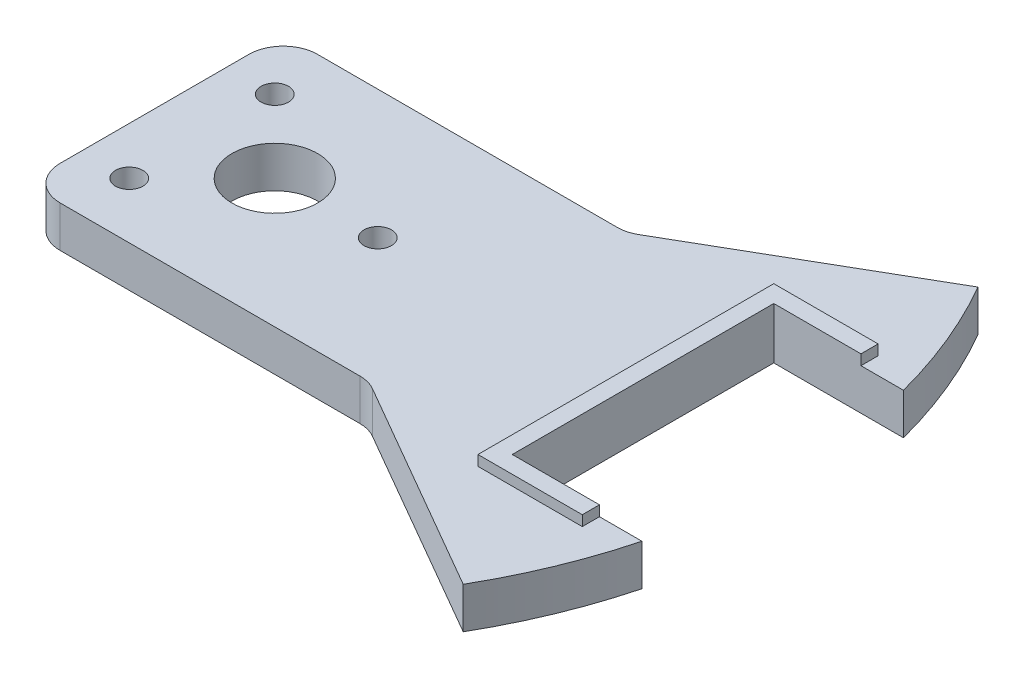
ISO-10303-21;
HEADER;
FILE_DESCRIPTION(('STEP AP214'),'2;1');
FILE_NAME('part.step','',(''),(''),'','','');
FILE_SCHEMA(('AUTOMOTIVE_DESIGN { 1 0 10303 214 1 1 1 1 }'));
ENDSEC;
DATA;
#1=APPLICATION_CONTEXT('core data for automotive mechanical design processes');
#2=APPLICATION_PROTOCOL_DEFINITION('international standard','automotive_design',2000,#1);
#3=PRODUCT_CONTEXT('',#1,'mechanical');
#4=PRODUCT('Part','Part','',(#3));
#5=PRODUCT_RELATED_PRODUCT_CATEGORY('part','',(#4));
#6=PRODUCT_DEFINITION_FORMATION('','',#4);
#7=PRODUCT_DEFINITION_CONTEXT('part definition',#1,'design');
#8=PRODUCT_DEFINITION('design','',#6,#7);
#9=PRODUCT_DEFINITION_SHAPE('','',#8);
#10=(LENGTH_UNIT() NAMED_UNIT(*) SI_UNIT(.MILLI.,.METRE.));
#11=(NAMED_UNIT(*) PLANE_ANGLE_UNIT() SI_UNIT($,.RADIAN.));
#12=(NAMED_UNIT(*) SI_UNIT($,.STERADIAN.) SOLID_ANGLE_UNIT());
#13=UNCERTAINTY_MEASURE_WITH_UNIT(LENGTH_MEASURE(1.E-05),#10,'distance_accuracy_value','');
#14=(GEOMETRIC_REPRESENTATION_CONTEXT(3) GLOBAL_UNCERTAINTY_ASSIGNED_CONTEXT((#13)) GLOBAL_UNIT_ASSIGNED_CONTEXT((#10,
#11,#12)) REPRESENTATION_CONTEXT('',''));
#15=CARTESIAN_POINT('',(0.,0.,0.));
#16=DIRECTION('',(0.,0.,1.));
#17=DIRECTION('',(1.,0.,0.));
#18=AXIS2_PLACEMENT_3D('',#15,#16,#17);
#19=CARTESIAN_POINT('',(0.,12.,0.));
#20=DIRECTION('',(0.,-1.,0.));
#21=DIRECTION('',(0.,0.,-1.));
#22=AXIS2_PLACEMENT_3D('',#19,#20,#21);
#23=CYLINDRICAL_SURFACE('',#22,150.);
#24=CARTESIAN_POINT('',(0.,12.,0.));
#25=DIRECTION('',(0.,1.,0.));
#26=DIRECTION('',(0.,0.,1.));
#27=AXIS2_PLACEMENT_3D('',#24,#25,#26);
#28=CIRCLE('',#27,150.);
#29=CARTESIAN_POINT('',(145.080632752963,12.,-38.1));
#30=VERTEX_POINT('',#29);
#31=CARTESIAN_POINT('',(129.903810567666,12.,-75.0000000000002));
#32=VERTEX_POINT('',#31);
#33=EDGE_CURVE('E272',#30,#32,#28,.T.);
#34=ORIENTED_EDGE('',*,*,#33,.F.);
#35=DIRECTION('',(0.,-1.,0.));
#36=VECTOR('',#35,1.);
#37=CARTESIAN_POINT('',(145.080632752963,12.,-38.1));
#38=LINE('',#37,#36);
#39=CARTESIAN_POINT('',(145.080632752963,0.,-38.1));
#40=VERTEX_POINT('',#39);
#41=EDGE_CURVE('E11',#30,#40,#38,.T.);
#42=ORIENTED_EDGE('',*,*,#41,.T.);
#43=CARTESIAN_POINT('',(0.,0.,0.));
#44=DIRECTION('',(0.,1.,0.));
#45=DIRECTION('',(0.,0.,1.));
#46=AXIS2_PLACEMENT_3D('',#43,#44,#45);
#47=CIRCLE('',#46,150.);
#48=CARTESIAN_POINT('',(129.903810567666,0.,-75.0000000000002));
#49=VERTEX_POINT('',#48);
#50=EDGE_CURVE('E265',#40,#49,#47,.T.);
#51=ORIENTED_EDGE('',*,*,#50,.T.);
#52=DIRECTION('',(0.,-1.,0.));
#53=VECTOR('',#52,1.);
#54=CARTESIAN_POINT('',(129.903810567666,12.,-75.0000000000002));
#55=LINE('',#54,#53);
#56=EDGE_CURVE('E338',#32,#49,#55,.T.);
#57=ORIENTED_EDGE('',*,*,#56,.F.);
#58=EDGE_LOOP('',(#34,#42,#51,#57));
#59=FACE_BOUND('',#58,.T.);
#60=ADVANCED_FACE('F35',(#59),#23,.T.);
#61=CARTESIAN_POINT('',(0.,12.,0.));
#62=DIRECTION('',(0.,1.,0.));
#63=DIRECTION('',(0.,0.,1.));
#64=AXIS2_PLACEMENT_3D('',#61,#62,#63);
#65=PLANE('',#64);
#66=DIRECTION('',(0.,0.,-1.));
#67=VECTOR('',#66,1.);
#68=CARTESIAN_POINT('',(132.7,12.,0.));
#69=LINE('',#68,#67);
#70=CARTESIAN_POINT('',(132.7,12.,-38.1));
#71=VERTEX_POINT('',#70);
#72=CARTESIAN_POINT('',(132.7,12.,-43.1));
#73=VERTEX_POINT('',#72);
#74=EDGE_CURVE('E211',#71,#73,#69,.T.);
#75=ORIENTED_EDGE('',*,*,#74,.F.);
#76=DIRECTION('',(-1.,0.,0.));
#77=VECTOR('',#76,1.);
#78=CARTESIAN_POINT('',(107.3,12.,-38.1));
#79=LINE('',#78,#77);
#80=EDGE_CURVE('E178',#30,#71,#79,.T.);
#81=ORIENTED_EDGE('',*,*,#80,.F.);
#82=ORIENTED_EDGE('',*,*,#33,.T.);
#83=DIRECTION('',(-0.866025403784437,0.,0.500000000000002));
#84=VECTOR('',#83,1.);
#85=CARTESIAN_POINT('',(67.2724133595216,12.,-38.8397459621556));
#86=LINE('',#85,#84);
#87=CARTESIAN_POINT('',(67.2724133595216,12.,-38.8397459621556));
#88=VERTEX_POINT('',#87);
#89=EDGE_CURVE('E271',#32,#88,#86,.T.);
#90=ORIENTED_EDGE('',*,*,#89,.T.);
#91=CARTESIAN_POINT('',(62.2724133595216,12.,-47.5000000000001));
#92=DIRECTION('',(0.,-1.,0.));
#93=DIRECTION('',(0.,0.,-1.));
#94=AXIS2_PLACEMENT_3D('',#91,#92,#93);
#95=CIRCLE('',#94,10.0000000000001);
#96=CARTESIAN_POINT('',(62.2724133595216,12.,-37.5));
#97=VERTEX_POINT('',#96);
#98=EDGE_CURVE('E274',#88,#97,#95,.T.);
#99=ORIENTED_EDGE('',*,*,#98,.T.);
#100=DIRECTION('',(-1.,0.,0.));
#101=VECTOR('',#100,1.);
#102=CARTESIAN_POINT('',(62.2724133595216,12.,-37.5));
#103=LINE('',#102,#101);
#104=CARTESIAN_POINT('',(-25.048094716167,12.,-37.4999999999998));
#105=VERTEX_POINT('',#104);
#106=EDGE_CURVE('E276',#97,#105,#103,.T.);
#107=ORIENTED_EDGE('',*,*,#106,.T.);
#108=CARTESIAN_POINT('',(-25.048094716167,12.,-27.4999999999998));
#109=DIRECTION('',(0.,1.,0.));
#110=DIRECTION('',(0.,0.,1.));
#111=AXIS2_PLACEMENT_3D('',#108,#109,#110);
#112=CIRCLE('',#111,10.);
#113=CARTESIAN_POINT('',(-35.048094716167,12.,-27.4999999999998));
#114=VERTEX_POINT('',#113);
#115=EDGE_CURVE('E278',#105,#114,#112,.T.);
#116=ORIENTED_EDGE('',*,*,#115,.T.);
#117=DIRECTION('',(0.,0.,1.));
#118=VECTOR('',#117,1.);
#119=CARTESIAN_POINT('',(-35.048094716167,12.,-27.4999999999998));
#120=LINE('',#119,#118);
#121=CARTESIAN_POINT('',(-35.0480947161671,12.,27.5000000000001));
#122=VERTEX_POINT('',#121);
#123=EDGE_CURVE('E280',#114,#122,#120,.T.);
#124=ORIENTED_EDGE('',*,*,#123,.T.);
#125=CARTESIAN_POINT('',(-25.0480947161671,12.,27.5000000000001));
#126=DIRECTION('',(0.,1.,0.));
#127=DIRECTION('',(0.,0.,1.));
#128=AXIS2_PLACEMENT_3D('',#125,#126,#127);
#129=CIRCLE('',#128,10.);
#130=CARTESIAN_POINT('',(-25.0480947161671,12.,37.5000000000001));
#131=VERTEX_POINT('',#130);
#132=EDGE_CURVE('E282',#122,#131,#129,.T.);
#133=ORIENTED_EDGE('',*,*,#132,.T.);
#134=DIRECTION('',(1.,0.,0.));
#135=VECTOR('',#134,1.);
#136=CARTESIAN_POINT('',(62.2724133595216,12.,37.5000000000001));
#137=LINE('',#136,#135);
#138=CARTESIAN_POINT('',(62.2724133595216,12.,37.5000000000001));
#139=VERTEX_POINT('',#138);
#140=EDGE_CURVE('E284',#131,#139,#137,.T.);
#141=ORIENTED_EDGE('',*,*,#140,.T.);
#142=CARTESIAN_POINT('',(62.2724133595216,12.,47.5000000000001));
#143=DIRECTION('',(0.,-1.,0.));
#144=DIRECTION('',(0.,0.,1.));
#145=AXIS2_PLACEMENT_3D('',#142,#143,#144);
#146=CIRCLE('',#145,10.);
#147=CARTESIAN_POINT('',(67.2724133595217,12.,38.8397459621557));
#148=VERTEX_POINT('',#147);
#149=EDGE_CURVE('E286',#139,#148,#146,.T.);
#150=ORIENTED_EDGE('',*,*,#149,.T.);
#151=DIRECTION('',(0.866025403784438,0.,0.500000000000001));
#152=VECTOR('',#151,1.);
#153=CARTESIAN_POINT('',(67.2724133595217,12.,38.8397459621557));
#154=LINE('',#153,#152);
#155=CARTESIAN_POINT('',(129.903810567666,12.,75.0000000000002));
#156=VERTEX_POINT('',#155);
#157=EDGE_CURVE('E288',#148,#156,#154,.T.);
#158=ORIENTED_EDGE('',*,*,#157,.T.);
#159=CARTESIAN_POINT('',(145.080632752963,12.,38.1));
#160=VERTEX_POINT('',#159);
#161=EDGE_CURVE('E268',#156,#160,#28,.T.);
#162=ORIENTED_EDGE('',*,*,#161,.T.);
#163=DIRECTION('',(1.,0.,0.));
#164=VECTOR('',#163,1.);
#165=CARTESIAN_POINT('',(107.3,12.,38.1));
#166=LINE('',#165,#164);
#167=CARTESIAN_POINT('',(132.7,12.,38.1));
#168=VERTEX_POINT('',#167);
#169=EDGE_CURVE('E58',#168,#160,#166,.T.);
#170=ORIENTED_EDGE('',*,*,#169,.F.);
#171=DIRECTION('',(0.,0.,1.));
#172=VECTOR('',#171,1.);
#173=CARTESIAN_POINT('',(132.7,12.,0.));
#174=LINE('',#173,#172);
#175=CARTESIAN_POINT('',(132.7,12.,43.1));
#176=VERTEX_POINT('',#175);
#177=EDGE_CURVE('E209',#168,#176,#174,.T.);
#178=ORIENTED_EDGE('',*,*,#177,.T.);
#179=DIRECTION('',(-1.,0.,0.));
#180=VECTOR('',#179,1.);
#181=CARTESIAN_POINT('',(0.,12.,43.1));
#182=LINE('',#181,#180);
#183=CARTESIAN_POINT('',(102.3,12.,43.1));
#184=VERTEX_POINT('',#183);
#185=EDGE_CURVE('E50',#176,#184,#182,.T.);
#186=ORIENTED_EDGE('',*,*,#185,.T.);
#187=DIRECTION('',(0.,0.,1.));
#188=VECTOR('',#187,1.);
#189=CARTESIAN_POINT('',(102.3,12.,0.));
#190=LINE('',#189,#188);
#191=CARTESIAN_POINT('',(102.3,12.,-43.1));
#192=VERTEX_POINT('',#191);
#193=EDGE_CURVE('E189',#192,#184,#190,.T.);
#194=ORIENTED_EDGE('',*,*,#193,.F.);
#195=DIRECTION('',(-1.,0.,0.));
#196=VECTOR('',#195,1.);
#197=CARTESIAN_POINT('',(0.,12.,-43.1));
#198=LINE('',#197,#196);
#199=EDGE_CURVE('E213',#73,#192,#198,.T.);
#200=ORIENTED_EDGE('',*,*,#199,.F.);
#201=EDGE_LOOP('',(#75,#81,#82,#90,#99,#107,#116,#124,#133,#141,#150,#158,#162,#170,#178,#186,
#194,#200));
#202=FACE_BOUND('',#201,.T.);
#203=CARTESIAN_POINT('',(-21.2132034355965,12.,-21.2132034355963));
#204=DIRECTION('',(0.,1.,0.));
#205=DIRECTION('',(0.,0.,1.));
#206=AXIS2_PLACEMENT_3D('',#203,#204,#205);
#207=CIRCLE('',#206,4.);
#208=CARTESIAN_POINT('',(-21.2132034355965,12.,-17.2132034355963));
#209=VERTEX_POINT('',#208);
#210=EDGE_CURVE('E250',#209,#209,#207,.T.);
#211=ORIENTED_EDGE('',*,*,#210,.F.);
#212=EDGE_LOOP('',(#211));
#213=FACE_BOUND('',#212,.T.);
#214=CARTESIAN_POINT('',(0.,12.,0.));
#215=DIRECTION('',(0.,1.,0.));
#216=DIRECTION('',(0.,0.,1.));
#217=AXIS2_PLACEMENT_3D('',#214,#215,#216);
#218=CIRCLE('',#217,12.5);
#219=CARTESIAN_POINT('',(0.,12.,12.5));
#220=VERTEX_POINT('',#219);
#221=EDGE_CURVE('E262',#220,#220,#218,.T.);
#222=ORIENTED_EDGE('',*,*,#221,.F.);
#223=EDGE_LOOP('',(#222));
#224=FACE_BOUND('',#223,.T.);
#225=CARTESIAN_POINT('',(30.,12.,0.));
#226=DIRECTION('',(0.,1.,0.));
#227=DIRECTION('',(0.,0.,1.));
#228=AXIS2_PLACEMENT_3D('',#225,#226,#227);
#229=CIRCLE('',#228,4.00000000000001);
#230=CARTESIAN_POINT('',(30.,12.,4.00000000000001));
#231=VERTEX_POINT('',#230);
#232=EDGE_CURVE('E256',#231,#231,#229,.T.);
#233=ORIENTED_EDGE('',*,*,#232,.F.);
#234=EDGE_LOOP('',(#233));
#235=FACE_BOUND('',#234,.T.);
#236=CARTESIAN_POINT('',(-21.2132034355965,12.,21.2132034355963));
#237=DIRECTION('',(0.,1.,0.));
#238=DIRECTION('',(0.,0.,-1.));
#239=AXIS2_PLACEMENT_3D('',#236,#237,#238);
#240=CIRCLE('',#239,4.);
#241=CARTESIAN_POINT('',(-21.2132034355965,12.,17.2132034355963));
#242=VERTEX_POINT('',#241);
#243=EDGE_CURVE('E244',#242,#242,#240,.T.);
#244=ORIENTED_EDGE('',*,*,#243,.F.);
#245=EDGE_LOOP('',(#244));
#246=FACE_BOUND('',#245,.T.);
#247=ADVANCED_FACE('F346',(#202,#213,#224,#235,#246),#65,.T.);
#248=CARTESIAN_POINT('',(0.,0.,0.));
#249=DIRECTION('',(0.,1.,0.));
#250=DIRECTION('',(0.,0.,1.));
#251=AXIS2_PLACEMENT_3D('',#248,#249,#250);
#252=PLANE('',#251);
#253=ORIENTED_EDGE('',*,*,#50,.F.);
#254=DIRECTION('',(-1.,0.,0.));
#255=VECTOR('',#254,1.);
#256=CARTESIAN_POINT('',(107.3,0.,-38.1));
#257=LINE('',#256,#255);
#258=CARTESIAN_POINT('',(107.3,0.,-38.1));
#259=VERTEX_POINT('',#258);
#260=EDGE_CURVE('E227',#40,#259,#257,.T.);
#261=ORIENTED_EDGE('',*,*,#260,.T.);
#262=DIRECTION('',(0.,0.,1.));
#263=VECTOR('',#262,1.);
#264=CARTESIAN_POINT('',(107.3,0.,-38.1));
#265=LINE('',#264,#263);
#266=CARTESIAN_POINT('',(107.3,0.,38.1));
#267=VERTEX_POINT('',#266);
#268=EDGE_CURVE('E230',#259,#267,#265,.T.);
#269=ORIENTED_EDGE('',*,*,#268,.T.);
#270=DIRECTION('',(1.,0.,0.));
#271=VECTOR('',#270,1.);
#272=CARTESIAN_POINT('',(107.3,0.,38.1));
#273=LINE('',#272,#271);
#274=CARTESIAN_POINT('',(145.080632752963,0.,38.1));
#275=VERTEX_POINT('',#274);
#276=EDGE_CURVE('E233',#267,#275,#273,.T.);
#277=ORIENTED_EDGE('',*,*,#276,.T.);
#278=CARTESIAN_POINT('',(129.903810567666,0.,75.0000000000002));
#279=VERTEX_POINT('',#278);
#280=EDGE_CURVE('E291',#279,#275,#47,.T.);
#281=ORIENTED_EDGE('',*,*,#280,.F.);
#282=DIRECTION('',(0.866025403784438,0.,0.500000000000001));
#283=VECTOR('',#282,1.);
#284=CARTESIAN_POINT('',(67.2724133595217,0.,38.8397459621557));
#285=LINE('',#284,#283);
#286=CARTESIAN_POINT('',(67.2724133595217,0.,38.8397459621557));
#287=VERTEX_POINT('',#286);
#288=EDGE_CURVE('E310',#287,#279,#285,.T.);
#289=ORIENTED_EDGE('',*,*,#288,.F.);
#290=CARTESIAN_POINT('',(62.2724133595216,0.,47.5000000000001));
#291=DIRECTION('',(0.,-1.,0.));
#292=DIRECTION('',(0.,0.,1.));
#293=AXIS2_PLACEMENT_3D('',#290,#291,#292);
#294=CIRCLE('',#293,10.);
#295=CARTESIAN_POINT('',(62.2724133595216,0.,37.5000000000001));
#296=VERTEX_POINT('',#295);
#297=EDGE_CURVE('E308',#296,#287,#294,.T.);
#298=ORIENTED_EDGE('',*,*,#297,.F.);
#299=DIRECTION('',(1.,0.,0.));
#300=VECTOR('',#299,1.);
#301=CARTESIAN_POINT('',(62.2724133595216,0.,37.5000000000001));
#302=LINE('',#301,#300);
#303=CARTESIAN_POINT('',(-25.0480947161671,0.,37.5000000000001));
#304=VERTEX_POINT('',#303);
#305=EDGE_CURVE('E306',#304,#296,#302,.T.);
#306=ORIENTED_EDGE('',*,*,#305,.F.);
#307=CARTESIAN_POINT('',(-25.0480947161671,0.,27.5000000000001));
#308=DIRECTION('',(0.,1.,0.));
#309=DIRECTION('',(0.,0.,1.));
#310=AXIS2_PLACEMENT_3D('',#307,#308,#309);
#311=CIRCLE('',#310,10.);
#312=CARTESIAN_POINT('',(-35.0480947161671,0.,27.5000000000001));
#313=VERTEX_POINT('',#312);
#314=EDGE_CURVE('E304',#313,#304,#311,.T.);
#315=ORIENTED_EDGE('',*,*,#314,.F.);
#316=DIRECTION('',(0.,0.,1.));
#317=VECTOR('',#316,1.);
#318=CARTESIAN_POINT('',(-35.048094716167,0.,-27.4999999999998));
#319=LINE('',#318,#317);
#320=CARTESIAN_POINT('',(-35.048094716167,0.,-27.4999999999998));
#321=VERTEX_POINT('',#320);
#322=EDGE_CURVE('E302',#321,#313,#319,.T.);
#323=ORIENTED_EDGE('',*,*,#322,.F.);
#324=CARTESIAN_POINT('',(-25.048094716167,0.,-27.4999999999998));
#325=DIRECTION('',(0.,1.,0.));
#326=DIRECTION('',(0.,0.,1.));
#327=AXIS2_PLACEMENT_3D('',#324,#325,#326);
#328=CIRCLE('',#327,10.);
#329=CARTESIAN_POINT('',(-25.048094716167,0.,-37.4999999999998));
#330=VERTEX_POINT('',#329);
#331=EDGE_CURVE('E300',#330,#321,#328,.T.);
#332=ORIENTED_EDGE('',*,*,#331,.F.);
#333=DIRECTION('',(-1.,0.,0.));
#334=VECTOR('',#333,1.);
#335=CARTESIAN_POINT('',(62.2724133595216,0.,-37.5));
#336=LINE('',#335,#334);
#337=CARTESIAN_POINT('',(62.2724133595216,0.,-37.5));
#338=VERTEX_POINT('',#337);
#339=EDGE_CURVE('E298',#338,#330,#336,.T.);
#340=ORIENTED_EDGE('',*,*,#339,.F.);
#341=CARTESIAN_POINT('',(62.2724133595216,0.,-47.5000000000001));
#342=DIRECTION('',(0.,-1.,0.));
#343=DIRECTION('',(0.,0.,-1.));
#344=AXIS2_PLACEMENT_3D('',#341,#342,#343);
#345=CIRCLE('',#344,10.0000000000001);
#346=CARTESIAN_POINT('',(67.2724133595216,0.,-38.8397459621556));
#347=VERTEX_POINT('',#346);
#348=EDGE_CURVE('E296',#347,#338,#345,.T.);
#349=ORIENTED_EDGE('',*,*,#348,.F.);
#350=DIRECTION('',(-0.866025403784437,0.,0.500000000000002));
#351=VECTOR('',#350,1.);
#352=CARTESIAN_POINT('',(67.2724133595216,0.,-38.8397459621556));
#353=LINE('',#352,#351);
#354=EDGE_CURVE('E294',#49,#347,#353,.T.);
#355=ORIENTED_EDGE('',*,*,#354,.F.);
#356=EDGE_LOOP('',(#253,#261,#269,#277,#281,#289,#298,#306,#315,#323,#332,#340,#349,#355));
#357=FACE_BOUND('',#356,.T.);
#358=CARTESIAN_POINT('',(0.,0.,0.));
#359=DIRECTION('',(0.,1.,0.));
#360=DIRECTION('',(0.,0.,1.));
#361=AXIS2_PLACEMENT_3D('',#358,#359,#360);
#362=CIRCLE('',#361,12.5);
#363=CARTESIAN_POINT('',(0.,0.,12.5));
#364=VERTEX_POINT('',#363);
#365=EDGE_CURVE('E259',#364,#364,#362,.T.);
#366=ORIENTED_EDGE('',*,*,#365,.T.);
#367=EDGE_LOOP('',(#366));
#368=FACE_BOUND('',#367,.T.);
#369=CARTESIAN_POINT('',(30.,0.,0.));
#370=DIRECTION('',(0.,1.,0.));
#371=DIRECTION('',(0.,0.,1.));
#372=AXIS2_PLACEMENT_3D('',#369,#370,#371);
#373=CIRCLE('',#372,4.00000000000001);
#374=CARTESIAN_POINT('',(30.,0.,4.00000000000001));
#375=VERTEX_POINT('',#374);
#376=EDGE_CURVE('E253',#375,#375,#373,.T.);
#377=ORIENTED_EDGE('',*,*,#376,.T.);
#378=EDGE_LOOP('',(#377));
#379=FACE_BOUND('',#378,.T.);
#380=CARTESIAN_POINT('',(-21.2132034355965,0.,-21.2132034355963));
#381=DIRECTION('',(0.,1.,0.));
#382=DIRECTION('',(0.,0.,1.));
#383=AXIS2_PLACEMENT_3D('',#380,#381,#382);
#384=CIRCLE('',#383,4.);
#385=CARTESIAN_POINT('',(-21.2132034355965,0.,-17.2132034355963));
#386=VERTEX_POINT('',#385);
#387=EDGE_CURVE('E247',#386,#386,#384,.T.);
#388=ORIENTED_EDGE('',*,*,#387,.T.);
#389=EDGE_LOOP('',(#388));
#390=FACE_BOUND('',#389,.T.);
#391=CARTESIAN_POINT('',(-21.2132034355965,0.,21.2132034355963));
#392=DIRECTION('',(0.,1.,0.));
#393=DIRECTION('',(0.,0.,-1.));
#394=AXIS2_PLACEMENT_3D('',#391,#392,#393);
#395=CIRCLE('',#394,4.);
#396=CARTESIAN_POINT('',(-21.2132034355965,0.,17.2132034355963));
#397=VERTEX_POINT('',#396);
#398=EDGE_CURVE('E242',#397,#397,#395,.T.);
#399=ORIENTED_EDGE('',*,*,#398,.T.);
#400=EDGE_LOOP('',(#399));
#401=FACE_BOUND('',#400,.T.);
#402=ADVANCED_FACE('F357',(#357,#368,#379,#390,#401),#252,.F.);
#403=ORIENTED_EDGE('',*,*,#280,.T.);
#404=DIRECTION('',(0.,-1.,0.));
#405=VECTOR('',#404,1.);
#406=CARTESIAN_POINT('',(145.080632752963,12.,38.1));
#407=LINE('',#406,#405);
#408=EDGE_CURVE('E43',#275,#160,#407,.F.);
#409=ORIENTED_EDGE('',*,*,#408,.T.);
#410=ORIENTED_EDGE('',*,*,#161,.F.);
#411=DIRECTION('',(0.,-1.,0.));
#412=VECTOR('',#411,1.);
#413=CARTESIAN_POINT('',(129.903810567666,12.,75.0000000000002));
#414=LINE('',#413,#412);
#415=EDGE_CURVE('E290',#156,#279,#414,.T.);
#416=ORIENTED_EDGE('',*,*,#415,.T.);
#417=EDGE_LOOP('',(#403,#409,#410,#416));
#418=FACE_BOUND('',#417,.T.);
#419=ADVANCED_FACE('F37',(#418),#23,.T.);
#420=CARTESIAN_POINT('',(67.2724133595216,12.,-38.8397459621556));
#421=DIRECTION('',(0.500000000000002,0.,0.866025403784437));
#422=DIRECTION('',(0.866025403784437,0.,-0.500000000000002));
#423=AXIS2_PLACEMENT_3D('',#420,#421,#422);
#424=PLANE('',#423);
#425=ORIENTED_EDGE('',*,*,#354,.T.);
#426=DIRECTION('',(0.,-1.,0.));
#427=VECTOR('',#426,1.);
#428=CARTESIAN_POINT('',(67.2724133595216,12.,-38.8397459621556));
#429=LINE('',#428,#427);
#430=EDGE_CURVE('E335',#88,#347,#429,.T.);
#431=ORIENTED_EDGE('',*,*,#430,.F.);
#432=ORIENTED_EDGE('',*,*,#89,.F.);
#433=ORIENTED_EDGE('',*,*,#56,.T.);
#434=EDGE_LOOP('',(#425,#431,#432,#433));
#435=FACE_BOUND('',#434,.T.);
#436=ADVANCED_FACE('F391',(#435),#424,.F.);
#437=CARTESIAN_POINT('',(62.2724133595216,12.,-47.5000000000001));
#438=DIRECTION('',(0.,-1.,0.));
#439=DIRECTION('',(0.,0.,-1.));
#440=AXIS2_PLACEMENT_3D('',#437,#438,#439);
#441=CYLINDRICAL_SURFACE('',#440,10.0000000000001);
#442=ORIENTED_EDGE('',*,*,#348,.T.);
#443=DIRECTION('',(0.,-1.,0.));
#444=VECTOR('',#443,1.);
#445=CARTESIAN_POINT('',(62.2724133595216,12.,-37.5));
#446=LINE('',#445,#444);
#447=EDGE_CURVE('E332',#97,#338,#446,.T.);
#448=ORIENTED_EDGE('',*,*,#447,.F.);
#449=ORIENTED_EDGE('',*,*,#98,.F.);
#450=ORIENTED_EDGE('',*,*,#430,.T.);
#451=EDGE_LOOP('',(#442,#448,#449,#450));
#452=FACE_BOUND('',#451,.T.);
#453=ADVANCED_FACE('F397',(#452),#441,.F.);
#454=CARTESIAN_POINT('',(62.2724133595216,12.,-37.5));
#455=DIRECTION('',(0.,0.,1.));
#456=DIRECTION('',(1.,0.,0.));
#457=AXIS2_PLACEMENT_3D('',#454,#455,#456);
#458=PLANE('',#457);
#459=ORIENTED_EDGE('',*,*,#339,.T.);
#460=DIRECTION('',(0.,-1.,0.));
#461=VECTOR('',#460,1.);
#462=CARTESIAN_POINT('',(-25.048094716167,12.,-37.4999999999998));
#463=LINE('',#462,#461);
#464=EDGE_CURVE('E329',#105,#330,#463,.T.);
#465=ORIENTED_EDGE('',*,*,#464,.F.);
#466=ORIENTED_EDGE('',*,*,#106,.F.);
#467=ORIENTED_EDGE('',*,*,#447,.T.);
#468=EDGE_LOOP('',(#459,#465,#466,#467));
#469=FACE_BOUND('',#468,.T.);
#470=ADVANCED_FACE('F399',(#469),#458,.F.);
#471=CARTESIAN_POINT('',(-25.048094716167,12.,-27.4999999999998));
#472=DIRECTION('',(0.,-1.,0.));
#473=DIRECTION('',(0.,0.,-1.));
#474=AXIS2_PLACEMENT_3D('',#471,#472,#473);
#475=CYLINDRICAL_SURFACE('',#474,10.);
#476=ORIENTED_EDGE('',*,*,#331,.T.);
#477=DIRECTION('',(0.,-1.,0.));
#478=VECTOR('',#477,1.);
#479=CARTESIAN_POINT('',(-35.048094716167,12.,-27.4999999999998));
#480=LINE('',#479,#478);
#481=EDGE_CURVE('E326',#114,#321,#480,.T.);
#482=ORIENTED_EDGE('',*,*,#481,.F.);
#483=ORIENTED_EDGE('',*,*,#115,.F.);
#484=ORIENTED_EDGE('',*,*,#464,.T.);
#485=EDGE_LOOP('',(#476,#482,#483,#484));
#486=FACE_BOUND('',#485,.T.);
#487=ADVANCED_FACE('F404',(#486),#475,.T.);
#488=CARTESIAN_POINT('',(-35.048094716167,12.,-27.4999999999998));
#489=DIRECTION('',(1.,0.,0.));
#490=DIRECTION('',(0.,0.,-1.));
#491=AXIS2_PLACEMENT_3D('',#488,#489,#490);
#492=PLANE('',#491);
#493=ORIENTED_EDGE('',*,*,#322,.T.);
#494=DIRECTION('',(0.,-1.,0.));
#495=VECTOR('',#494,1.);
#496=CARTESIAN_POINT('',(-35.0480947161671,12.,27.5000000000001));
#497=LINE('',#496,#495);
#498=EDGE_CURVE('E323',#122,#313,#497,.T.);
#499=ORIENTED_EDGE('',*,*,#498,.F.);
#500=ORIENTED_EDGE('',*,*,#123,.F.);
#501=ORIENTED_EDGE('',*,*,#481,.T.);
#502=EDGE_LOOP('',(#493,#499,#500,#501));
#503=FACE_BOUND('',#502,.T.);
#504=ADVANCED_FACE('F410',(#503),#492,.F.);
#505=CARTESIAN_POINT('',(-25.0480947161671,12.,27.5000000000001));
#506=DIRECTION('',(0.,-1.,0.));
#507=DIRECTION('',(0.,0.,-1.));
#508=AXIS2_PLACEMENT_3D('',#505,#506,#507);
#509=CYLINDRICAL_SURFACE('',#508,10.);
#510=ORIENTED_EDGE('',*,*,#314,.T.);
#511=DIRECTION('',(0.,-1.,0.));
#512=VECTOR('',#511,1.);
#513=CARTESIAN_POINT('',(-25.0480947161671,12.,37.5000000000001));
#514=LINE('',#513,#512);
#515=EDGE_CURVE('E320',#131,#304,#514,.T.);
#516=ORIENTED_EDGE('',*,*,#515,.F.);
#517=ORIENTED_EDGE('',*,*,#132,.F.);
#518=ORIENTED_EDGE('',*,*,#498,.T.);
#519=EDGE_LOOP('',(#510,#516,#517,#518));
#520=FACE_BOUND('',#519,.T.);
#521=ADVANCED_FACE('F414',(#520),#509,.T.);
#522=CARTESIAN_POINT('',(62.2724133595216,12.,37.5000000000001));
#523=DIRECTION('',(0.,0.,-1.));
#524=DIRECTION('',(-1.,0.,0.));
#525=AXIS2_PLACEMENT_3D('',#522,#523,#524);
#526=PLANE('',#525);
#527=ORIENTED_EDGE('',*,*,#305,.T.);
#528=DIRECTION('',(0.,-1.,0.));
#529=VECTOR('',#528,1.);
#530=CARTESIAN_POINT('',(62.2724133595216,12.,37.5000000000001));
#531=LINE('',#530,#529);
#532=EDGE_CURVE('E317',#139,#296,#531,.T.);
#533=ORIENTED_EDGE('',*,*,#532,.F.);
#534=ORIENTED_EDGE('',*,*,#140,.F.);
#535=ORIENTED_EDGE('',*,*,#515,.T.);
#536=EDGE_LOOP('',(#527,#533,#534,#535));
#537=FACE_BOUND('',#536,.T.);
#538=ADVANCED_FACE('F419',(#537),#526,.F.);
#539=CARTESIAN_POINT('',(62.2724133595216,12.,47.5000000000001));
#540=DIRECTION('',(0.,-1.,0.));
#541=DIRECTION('',(0.,0.,-1.));
#542=AXIS2_PLACEMENT_3D('',#539,#540,#541);
#543=CYLINDRICAL_SURFACE('',#542,10.);
#544=ORIENTED_EDGE('',*,*,#297,.T.);
#545=DIRECTION('',(0.,-1.,0.));
#546=VECTOR('',#545,1.);
#547=CARTESIAN_POINT('',(67.2724133595217,12.,38.8397459621557));
#548=LINE('',#547,#546);
#549=EDGE_CURVE('E314',#148,#287,#548,.T.);
#550=ORIENTED_EDGE('',*,*,#549,.F.);
#551=ORIENTED_EDGE('',*,*,#149,.F.);
#552=ORIENTED_EDGE('',*,*,#532,.T.);
#553=EDGE_LOOP('',(#544,#550,#551,#552));
#554=FACE_BOUND('',#553,.T.);
#555=ADVANCED_FACE('F421',(#554),#543,.F.);
#556=CARTESIAN_POINT('',(67.2724133595217,12.,38.8397459621557));
#557=DIRECTION('',(0.500000000000001,0.,-0.866025403784438));
#558=DIRECTION('',(-0.866025403784438,0.,-0.500000000000001));
#559=AXIS2_PLACEMENT_3D('',#556,#557,#558);
#560=PLANE('',#559);
#561=ORIENTED_EDGE('',*,*,#288,.T.);
#562=ORIENTED_EDGE('',*,*,#415,.F.);
#563=ORIENTED_EDGE('',*,*,#157,.F.);
#564=ORIENTED_EDGE('',*,*,#549,.T.);
#565=EDGE_LOOP('',(#561,#562,#563,#564));
#566=FACE_BOUND('',#565,.T.);
#567=ADVANCED_FACE('F353',(#566),#560,.F.);
#568=CARTESIAN_POINT('',(0.,12.,0.));
#569=DIRECTION('',(0.,-1.,0.));
#570=DIRECTION('',(0.,0.,-1.));
#571=AXIS2_PLACEMENT_3D('',#568,#569,#570);
#572=CYLINDRICAL_SURFACE('',#571,12.5);
#573=ORIENTED_EDGE('',*,*,#221,.T.);
#574=EDGE_LOOP('',(#573));
#575=FACE_BOUND('',#574,.T.);
#576=ORIENTED_EDGE('',*,*,#365,.F.);
#577=EDGE_LOOP('',(#576));
#578=FACE_BOUND('',#577,.T.);
#579=ADVANCED_FACE('F428',(#575,#578),#572,.F.);
#580=CARTESIAN_POINT('',(30.,12.,0.));
#581=DIRECTION('',(0.,-1.,0.));
#582=DIRECTION('',(0.,0.,-1.));
#583=AXIS2_PLACEMENT_3D('',#580,#581,#582);
#584=CYLINDRICAL_SURFACE('',#583,4.00000000000001);
#585=ORIENTED_EDGE('',*,*,#232,.T.);
#586=EDGE_LOOP('',(#585));
#587=FACE_BOUND('',#586,.T.);
#588=ORIENTED_EDGE('',*,*,#376,.F.);
#589=EDGE_LOOP('',(#588));
#590=FACE_BOUND('',#589,.T.);
#591=ADVANCED_FACE('F447',(#587,#590),#584,.F.);
#592=CARTESIAN_POINT('',(-21.2132034355965,12.,-21.2132034355963));
#593=DIRECTION('',(0.,-1.,0.));
#594=DIRECTION('',(0.,0.,-1.));
#595=AXIS2_PLACEMENT_3D('',#592,#593,#594);
#596=CYLINDRICAL_SURFACE('',#595,4.);
#597=ORIENTED_EDGE('',*,*,#210,.T.);
#598=EDGE_LOOP('',(#597));
#599=FACE_BOUND('',#598,.T.);
#600=ORIENTED_EDGE('',*,*,#387,.F.);
#601=EDGE_LOOP('',(#600));
#602=FACE_BOUND('',#601,.T.);
#603=ADVANCED_FACE('F451',(#599,#602),#596,.F.);
#604=CARTESIAN_POINT('',(-21.2132034355965,12.,21.2132034355963));
#605=DIRECTION('',(0.,-1.,0.));
#606=DIRECTION('',(0.,0.,-1.));
#607=AXIS2_PLACEMENT_3D('',#604,#605,#606);
#608=CYLINDRICAL_SURFACE('',#607,4.);
#609=ORIENTED_EDGE('',*,*,#243,.T.);
#610=EDGE_LOOP('',(#609));
#611=FACE_BOUND('',#610,.T.);
#612=ORIENTED_EDGE('',*,*,#398,.F.);
#613=EDGE_LOOP('',(#612));
#614=FACE_BOUND('',#613,.T.);
#615=ADVANCED_FACE('F455',(#611,#614),#608,.F.);
#616=CARTESIAN_POINT('',(107.3,0.,-38.1));
#617=DIRECTION('',(0.,0.,-1.));
#618=DIRECTION('',(-1.,0.,0.));
#619=AXIS2_PLACEMENT_3D('',#616,#617,#618);
#620=PLANE('',#619);
#621=ORIENTED_EDGE('',*,*,#80,.T.);
#622=DIRECTION('',(0.,-1.,0.));
#623=VECTOR('',#622,1.);
#624=CARTESIAN_POINT('',(132.7,15.,-38.1));
#625=LINE('',#624,#623);
#626=CARTESIAN_POINT('',(132.7,15.,-38.1));
#627=VERTEX_POINT('',#626);
#628=EDGE_CURVE('E224',#627,#71,#625,.T.);
#629=ORIENTED_EDGE('',*,*,#628,.F.);
#630=DIRECTION('',(1.,0.,0.));
#631=VECTOR('',#630,1.);
#632=CARTESIAN_POINT('',(0.,15.,-38.1));
#633=LINE('',#632,#631);
#634=CARTESIAN_POINT('',(107.3,15.,-38.1));
#635=VERTEX_POINT('',#634);
#636=EDGE_CURVE('E200',#635,#627,#633,.T.);
#637=ORIENTED_EDGE('',*,*,#636,.F.);
#638=DIRECTION('',(0.,1.,0.));
#639=VECTOR('',#638,1.);
#640=CARTESIAN_POINT('',(107.3,0.,-38.1));
#641=LINE('',#640,#639);
#642=EDGE_CURVE('E236',#259,#635,#641,.T.);
#643=ORIENTED_EDGE('',*,*,#642,.F.);
#644=ORIENTED_EDGE('',*,*,#260,.F.);
#645=ORIENTED_EDGE('',*,*,#41,.F.);
#646=EDGE_LOOP('',(#621,#629,#637,#643,#644,#645));
#647=FACE_BOUND('',#646,.T.);
#648=ADVANCED_FACE('F367',(#647),#620,.F.);
#649=CARTESIAN_POINT('',(107.3,0.,38.1));
#650=DIRECTION('',(0.,0.,1.));
#651=DIRECTION('',(1.,0.,0.));
#652=AXIS2_PLACEMENT_3D('',#649,#650,#651);
#653=PLANE('',#652);
#654=ORIENTED_EDGE('',*,*,#276,.F.);
#655=DIRECTION('',(0.,1.,0.));
#656=VECTOR('',#655,1.);
#657=CARTESIAN_POINT('',(107.3,0.,38.1));
#658=LINE('',#657,#656);
#659=CARTESIAN_POINT('',(107.3,15.,38.1));
#660=VERTEX_POINT('',#659);
#661=EDGE_CURVE('E240',#267,#660,#658,.T.);
#662=ORIENTED_EDGE('',*,*,#661,.T.);
#663=DIRECTION('',(-1.,0.,0.));
#664=VECTOR('',#663,1.);
#665=CARTESIAN_POINT('',(0.,15.,38.1));
#666=LINE('',#665,#664);
#667=CARTESIAN_POINT('',(132.7,15.,38.1));
#668=VERTEX_POINT('',#667);
#669=EDGE_CURVE('E193',#668,#660,#666,.T.);
#670=ORIENTED_EDGE('',*,*,#669,.F.);
#671=DIRECTION('',(0.,-1.,0.));
#672=VECTOR('',#671,1.);
#673=CARTESIAN_POINT('',(132.7,15.,38.1));
#674=LINE('',#673,#672);
#675=EDGE_CURVE('E179',#668,#168,#674,.T.);
#676=ORIENTED_EDGE('',*,*,#675,.T.);
#677=ORIENTED_EDGE('',*,*,#169,.T.);
#678=ORIENTED_EDGE('',*,*,#408,.F.);
#679=EDGE_LOOP('',(#654,#662,#670,#676,#677,#678));
#680=FACE_BOUND('',#679,.T.);
#681=ADVANCED_FACE('F361',(#680),#653,.F.);
#682=CARTESIAN_POINT('',(107.3,0.,-38.1));
#683=DIRECTION('',(-1.,0.,0.));
#684=DIRECTION('',(0.,0.,1.));
#685=AXIS2_PLACEMENT_3D('',#682,#683,#684);
#686=PLANE('',#685);
#687=ORIENTED_EDGE('',*,*,#642,.T.);
#688=DIRECTION('',(0.,0.,-1.));
#689=VECTOR('',#688,1.);
#690=CARTESIAN_POINT('',(107.3,15.,0.));
#691=LINE('',#690,#689);
#692=EDGE_CURVE('E195',#660,#635,#691,.T.);
#693=ORIENTED_EDGE('',*,*,#692,.F.);
#694=ORIENTED_EDGE('',*,*,#661,.F.);
#695=ORIENTED_EDGE('',*,*,#268,.F.);
#696=EDGE_LOOP('',(#687,#693,#694,#695));
#697=FACE_BOUND('',#696,.T.);
#698=ADVANCED_FACE('F365',(#697),#686,.F.);
#699=CARTESIAN_POINT('',(0.,15.,43.1));
#700=DIRECTION('',(0.,0.,1.));
#701=DIRECTION('',(1.,0.,0.));
#702=AXIS2_PLACEMENT_3D('',#699,#700,#701);
#703=PLANE('',#702);
#704=ORIENTED_EDGE('',*,*,#185,.F.);
#705=DIRECTION('',(0.,-1.,0.));
#706=VECTOR('',#705,1.);
#707=CARTESIAN_POINT('',(132.7,15.,43.1));
#708=LINE('',#707,#706);
#709=CARTESIAN_POINT('',(132.7,15.,43.1));
#710=VERTEX_POINT('',#709);
#711=EDGE_CURVE('E170',#710,#176,#708,.T.);
#712=ORIENTED_EDGE('',*,*,#711,.F.);
#713=DIRECTION('',(-1.,0.,0.));
#714=VECTOR('',#713,1.);
#715=CARTESIAN_POINT('',(0.,15.,43.1));
#716=LINE('',#715,#714);
#717=CARTESIAN_POINT('',(102.3,15.,43.1));
#718=VERTEX_POINT('',#717);
#719=EDGE_CURVE('E173',#710,#718,#716,.T.);
#720=ORIENTED_EDGE('',*,*,#719,.T.);
#721=DIRECTION('',(0.,-1.,0.));
#722=VECTOR('',#721,1.);
#723=CARTESIAN_POINT('',(102.3,15.,43.1));
#724=LINE('',#723,#722);
#725=EDGE_CURVE('E207',#718,#184,#724,.T.);
#726=ORIENTED_EDGE('',*,*,#725,.T.);
#727=EDGE_LOOP('',(#704,#712,#720,#726));
#728=FACE_BOUND('',#727,.T.);
#729=ADVANCED_FACE('F172',(#728),#703,.T.);
#730=CARTESIAN_POINT('',(132.7,15.,0.));
#731=DIRECTION('',(1.,0.,0.));
#732=DIRECTION('',(0.,0.,-1.));
#733=AXIS2_PLACEMENT_3D('',#730,#731,#732);
#734=PLANE('',#733);
#735=ORIENTED_EDGE('',*,*,#177,.F.);
#736=ORIENTED_EDGE('',*,*,#675,.F.);
#737=DIRECTION('',(0.,0.,1.));
#738=VECTOR('',#737,1.);
#739=CARTESIAN_POINT('',(132.7,15.,0.));
#740=LINE('',#739,#738);
#741=EDGE_CURVE('E185',#668,#710,#740,.T.);
#742=ORIENTED_EDGE('',*,*,#741,.T.);
#743=ORIENTED_EDGE('',*,*,#711,.T.);
#744=EDGE_LOOP('',(#735,#736,#742,#743));
#745=FACE_BOUND('',#744,.T.);
#746=ADVANCED_FACE('F191',(#745),#734,.T.);
#747=CARTESIAN_POINT('',(132.7,15.,0.));
#748=DIRECTION('',(-1.,0.,0.));
#749=DIRECTION('',(0.,0.,1.));
#750=AXIS2_PLACEMENT_3D('',#747,#748,#749);
#751=PLANE('',#750);
#752=ORIENTED_EDGE('',*,*,#74,.T.);
#753=DIRECTION('',(0.,-1.,0.));
#754=VECTOR('',#753,1.);
#755=CARTESIAN_POINT('',(132.7,15.,-43.1));
#756=LINE('',#755,#754);
#757=CARTESIAN_POINT('',(132.7,15.,-43.1));
#758=VERTEX_POINT('',#757);
#759=EDGE_CURVE('E221',#758,#73,#756,.T.);
#760=ORIENTED_EDGE('',*,*,#759,.F.);
#761=DIRECTION('',(0.,0.,-1.));
#762=VECTOR('',#761,1.);
#763=CARTESIAN_POINT('',(132.7,15.,0.));
#764=LINE('',#763,#762);
#765=EDGE_CURVE('E202',#627,#758,#764,.T.);
#766=ORIENTED_EDGE('',*,*,#765,.F.);
#767=ORIENTED_EDGE('',*,*,#628,.T.);
#768=EDGE_LOOP('',(#752,#760,#766,#767));
#769=FACE_BOUND('',#768,.T.);
#770=ADVANCED_FACE('F374',(#769),#751,.F.);
#771=CARTESIAN_POINT('',(0.,15.,-43.1));
#772=DIRECTION('',(0.,0.,1.));
#773=DIRECTION('',(1.,0.,0.));
#774=AXIS2_PLACEMENT_3D('',#771,#772,#773);
#775=PLANE('',#774);
#776=ORIENTED_EDGE('',*,*,#199,.T.);
#777=DIRECTION('',(0.,-1.,0.));
#778=VECTOR('',#777,1.);
#779=CARTESIAN_POINT('',(102.3,15.,-43.1));
#780=LINE('',#779,#778);
#781=CARTESIAN_POINT('',(102.3,15.,-43.1));
#782=VERTEX_POINT('',#781);
#783=EDGE_CURVE('E218',#782,#192,#780,.T.);
#784=ORIENTED_EDGE('',*,*,#783,.F.);
#785=DIRECTION('',(-1.,0.,0.));
#786=VECTOR('',#785,1.);
#787=CARTESIAN_POINT('',(0.,15.,-43.1));
#788=LINE('',#787,#786);
#789=EDGE_CURVE('E204',#758,#782,#788,.T.);
#790=ORIENTED_EDGE('',*,*,#789,.F.);
#791=ORIENTED_EDGE('',*,*,#759,.T.);
#792=EDGE_LOOP('',(#776,#784,#790,#791));
#793=FACE_BOUND('',#792,.T.);
#794=ADVANCED_FACE('F377',(#793),#775,.F.);
#795=CARTESIAN_POINT('',(102.3,15.,0.));
#796=DIRECTION('',(1.,0.,0.));
#797=DIRECTION('',(0.,0.,-1.));
#798=AXIS2_PLACEMENT_3D('',#795,#796,#797);
#799=PLANE('',#798);
#800=ORIENTED_EDGE('',*,*,#193,.T.);
#801=ORIENTED_EDGE('',*,*,#725,.F.);
#802=DIRECTION('',(0.,0.,1.));
#803=VECTOR('',#802,1.);
#804=CARTESIAN_POINT('',(102.3,15.,0.));
#805=LINE('',#804,#803);
#806=EDGE_CURVE('E187',#782,#718,#805,.T.);
#807=ORIENTED_EDGE('',*,*,#806,.F.);
#808=ORIENTED_EDGE('',*,*,#783,.T.);
#809=EDGE_LOOP('',(#800,#801,#807,#808));
#810=FACE_BOUND('',#809,.T.);
#811=ADVANCED_FACE('F380',(#810),#799,.F.);
#812=CARTESIAN_POINT('',(0.,15.,0.));
#813=DIRECTION('',(0.,1.,0.));
#814=DIRECTION('',(0.,0.,1.));
#815=AXIS2_PLACEMENT_3D('',#812,#813,#814);
#816=PLANE('',#815);
#817=ORIENTED_EDGE('',*,*,#719,.F.);
#818=ORIENTED_EDGE('',*,*,#741,.F.);
#819=ORIENTED_EDGE('',*,*,#669,.T.);
#820=ORIENTED_EDGE('',*,*,#692,.T.);
#821=ORIENTED_EDGE('',*,*,#636,.T.);
#822=ORIENTED_EDGE('',*,*,#765,.T.);
#823=ORIENTED_EDGE('',*,*,#789,.T.);
#824=ORIENTED_EDGE('',*,*,#806,.T.);
#825=EDGE_LOOP('',(#817,#818,#819,#820,#821,#822,#823,#824));
#826=FACE_BOUND('',#825,.T.);
#827=ADVANCED_FACE('F183',(#826),#816,.T.);
#828=CLOSED_SHELL('',(#60,#247,#402,#419,#436,#453,#470,#487,#504,#521,#538,#555,#567,#579,#591,
#603,#615,#648,#681,#698,#729,#746,#770,#794,#811,#827));
#829=MANIFOLD_SOLID_BREP('B2',#828);
#830=ADVANCED_BREP_SHAPE_REPRESENTATION('',(#18,#829),#14);
#831=SHAPE_DEFINITION_REPRESENTATION(#9,#830);
ENDSEC;
END-ISO-10303-21;
